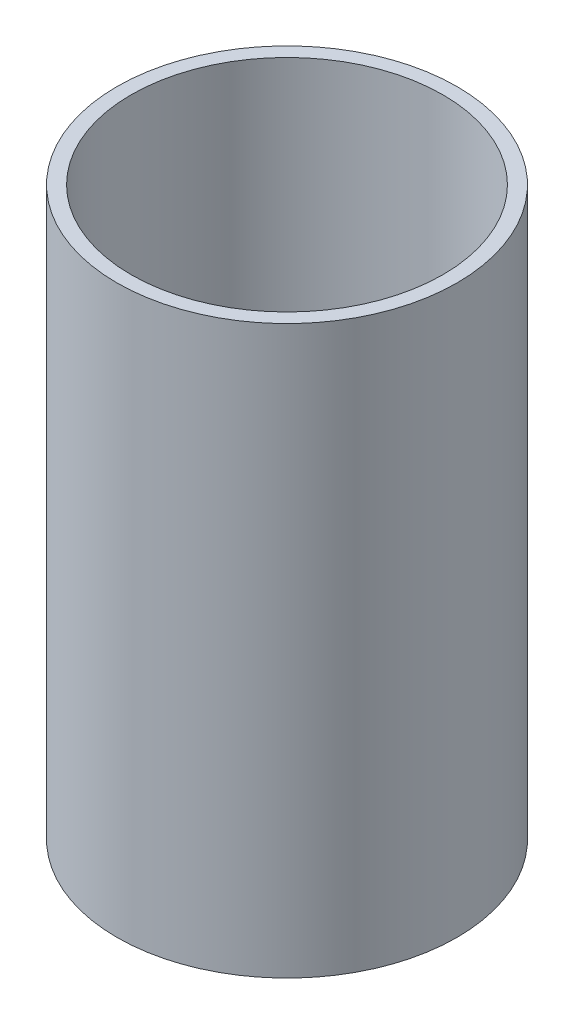
ISO-10303-21;
HEADER;
FILE_DESCRIPTION(('STEP AP214'),'2;1');
FILE_NAME('part.step','',(''),(''),'','','');
FILE_SCHEMA(('AUTOMOTIVE_DESIGN { 1 0 10303 214 1 1 1 1 }'));
ENDSEC;
DATA;
#1=APPLICATION_CONTEXT('core data for automotive mechanical design processes');
#2=APPLICATION_PROTOCOL_DEFINITION('international standard','automotive_design',2000,#1);
#3=PRODUCT_CONTEXT('',#1,'mechanical');
#4=PRODUCT('Part','Part','',(#3));
#5=PRODUCT_RELATED_PRODUCT_CATEGORY('part','',(#4));
#6=PRODUCT_DEFINITION_FORMATION('','',#4);
#7=PRODUCT_DEFINITION_CONTEXT('part definition',#1,'design');
#8=PRODUCT_DEFINITION('design','',#6,#7);
#9=PRODUCT_DEFINITION_SHAPE('','',#8);
#10=(LENGTH_UNIT() NAMED_UNIT(*) SI_UNIT(.MILLI.,.METRE.));
#11=(NAMED_UNIT(*) PLANE_ANGLE_UNIT() SI_UNIT($,.RADIAN.));
#12=(NAMED_UNIT(*) SI_UNIT($,.STERADIAN.) SOLID_ANGLE_UNIT());
#13=UNCERTAINTY_MEASURE_WITH_UNIT(LENGTH_MEASURE(1.E-05),#10,'distance_accuracy_value','');
#14=(GEOMETRIC_REPRESENTATION_CONTEXT(3) GLOBAL_UNCERTAINTY_ASSIGNED_CONTEXT((#13)) GLOBAL_UNIT_ASSIGNED_CONTEXT((#10,
#11,#12)) REPRESENTATION_CONTEXT('',''));
#15=CARTESIAN_POINT('',(0.,0.,0.));
#16=DIRECTION('',(0.,0.,1.));
#17=DIRECTION('',(1.,0.,0.));
#18=AXIS2_PLACEMENT_3D('',#15,#16,#17);
#19=CARTESIAN_POINT('',(0.,127.,0.));
#20=DIRECTION('',(0.,-1.,0.));
#21=DIRECTION('',(0.,0.,-1.));
#22=AXIS2_PLACEMENT_3D('',#19,#20,#21);
#23=CYLINDRICAL_SURFACE('',#22,38.1);
#24=CARTESIAN_POINT('',(0.,127.,0.));
#25=DIRECTION('',(0.,1.,0.));
#26=DIRECTION('',(0.,0.,1.));
#27=AXIS2_PLACEMENT_3D('',#24,#25,#26);
#28=CIRCLE('',#27,38.1);
#29=CARTESIAN_POINT('',(0.,127.,38.1));
#30=VERTEX_POINT('',#29);
#31=EDGE_CURVE('E10',#30,#30,#28,.T.);
#32=ORIENTED_EDGE('',*,*,#31,.F.);
#33=EDGE_LOOP('',(#32));
#34=FACE_BOUND('',#33,.T.);
#35=CARTESIAN_POINT('',(0.,0.,0.));
#36=DIRECTION('',(0.,1.,0.));
#37=DIRECTION('',(0.,0.,1.));
#38=AXIS2_PLACEMENT_3D('',#35,#36,#37);
#39=CIRCLE('',#38,38.1);
#40=CARTESIAN_POINT('',(0.,0.,38.1));
#41=VERTEX_POINT('',#40);
#42=EDGE_CURVE('E34',#41,#41,#39,.T.);
#43=ORIENTED_EDGE('',*,*,#42,.T.);
#44=EDGE_LOOP('',(#43));
#45=FACE_BOUND('',#44,.T.);
#46=ADVANCED_FACE('F31',(#34,#45),#23,.T.);
#47=CARTESIAN_POINT('',(0.,127.,0.));
#48=DIRECTION('',(0.,1.,0.));
#49=DIRECTION('',(0.,0.,1.));
#50=AXIS2_PLACEMENT_3D('',#47,#48,#49);
#51=PLANE('',#50);
#52=CARTESIAN_POINT('',(0.,127.,0.));
#53=DIRECTION('',(0.,1.,0.));
#54=DIRECTION('',(0.,0.,1.));
#55=AXIS2_PLACEMENT_3D('',#52,#53,#54);
#56=CIRCLE('',#55,34.925);
#57=CARTESIAN_POINT('',(0.,127.,34.925));
#58=VERTEX_POINT('',#57);
#59=EDGE_CURVE('E43',#58,#58,#56,.T.);
#60=ORIENTED_EDGE('',*,*,#59,.F.);
#61=EDGE_LOOP('',(#60));
#62=FACE_BOUND('',#61,.T.);
#63=ORIENTED_EDGE('',*,*,#31,.T.);
#64=EDGE_LOOP('',(#63));
#65=FACE_BOUND('',#64,.T.);
#66=ADVANCED_FACE('F58',(#62,#65),#51,.T.);
#67=CARTESIAN_POINT('',(0.,0.,0.));
#68=DIRECTION('',(0.,1.,0.));
#69=DIRECTION('',(0.,0.,1.));
#70=AXIS2_PLACEMENT_3D('',#67,#68,#69);
#71=PLANE('',#70);
#72=CARTESIAN_POINT('',(0.,0.,0.));
#73=DIRECTION('',(0.,1.,0.));
#74=DIRECTION('',(0.,0.,1.));
#75=AXIS2_PLACEMENT_3D('',#72,#73,#74);
#76=CIRCLE('',#75,34.925);
#77=CARTESIAN_POINT('',(0.,0.,34.925));
#78=VERTEX_POINT('',#77);
#79=EDGE_CURVE('E41',#78,#78,#76,.T.);
#80=ORIENTED_EDGE('',*,*,#79,.T.);
#81=EDGE_LOOP('',(#80));
#82=FACE_BOUND('',#81,.T.);
#83=ORIENTED_EDGE('',*,*,#42,.F.);
#84=EDGE_LOOP('',(#83));
#85=FACE_BOUND('',#84,.T.);
#86=ADVANCED_FACE('F49',(#82,#85),#71,.F.);
#87=CARTESIAN_POINT('',(0.,0.,0.));
#88=DIRECTION('',(0.,1.,0.));
#89=DIRECTION('',(0.,0.,1.));
#90=AXIS2_PLACEMENT_3D('',#87,#88,#89);
#91=CYLINDRICAL_SURFACE('',#90,34.925);
#92=ORIENTED_EDGE('',*,*,#79,.F.);
#93=EDGE_LOOP('',(#92));
#94=FACE_BOUND('',#93,.T.);
#95=ORIENTED_EDGE('',*,*,#59,.T.);
#96=EDGE_LOOP('',(#95));
#97=FACE_BOUND('',#96,.T.);
#98=ADVANCED_FACE('F52',(#94,#97),#91,.F.);
#99=CLOSED_SHELL('',(#46,#66,#86,#98));
#100=MANIFOLD_SOLID_BREP('B2',#99);
#101=ADVANCED_BREP_SHAPE_REPRESENTATION('',(#18,#100),#14);
#102=SHAPE_DEFINITION_REPRESENTATION(#9,#101);
ENDSEC;
END-ISO-10303-21;
